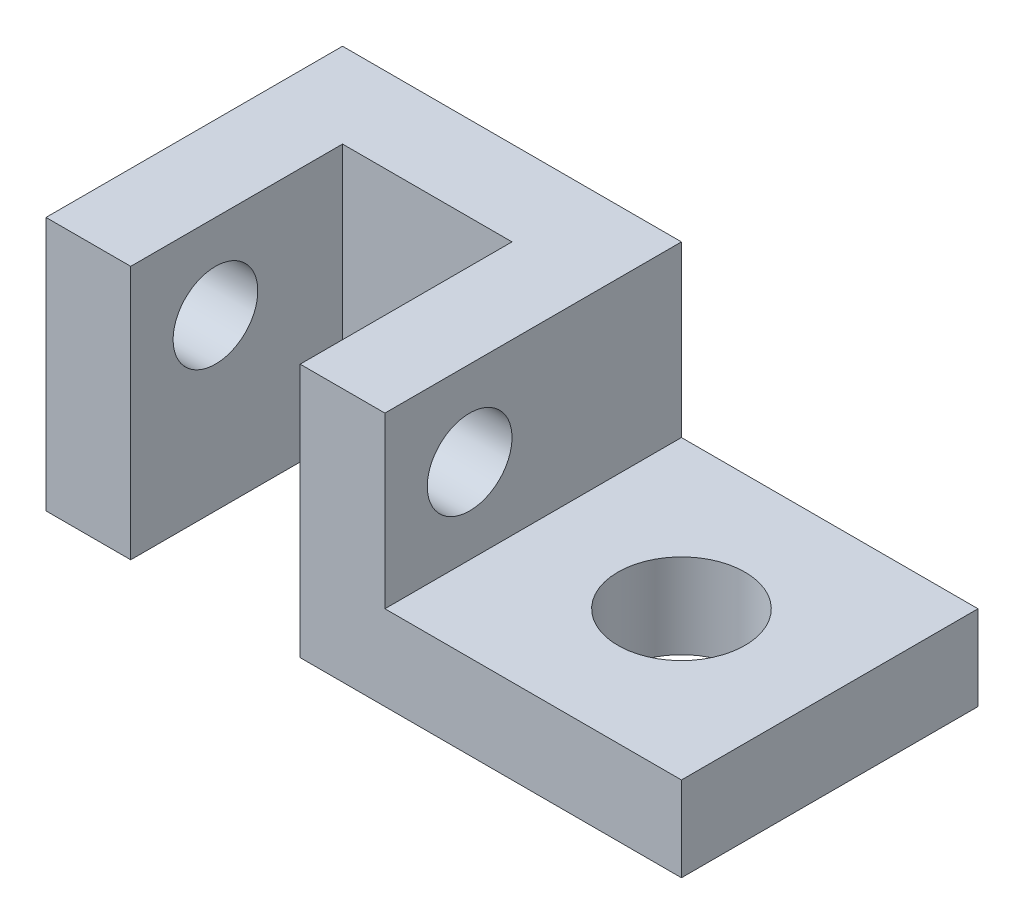
ISO-10303-21;
HEADER;
FILE_DESCRIPTION(('STEP AP214'),'2;1');
FILE_NAME('part.step','',(''),(''),'','','');
FILE_SCHEMA(('AUTOMOTIVE_DESIGN { 1 0 10303 214 1 1 1 1 }'));
ENDSEC;
DATA;
#1=APPLICATION_CONTEXT('core data for automotive mechanical design processes');
#2=APPLICATION_PROTOCOL_DEFINITION('international standard','automotive_design',2000,#1);
#3=PRODUCT_CONTEXT('',#1,'mechanical');
#4=PRODUCT('Part','Part','',(#3));
#5=PRODUCT_RELATED_PRODUCT_CATEGORY('part','',(#4));
#6=PRODUCT_DEFINITION_FORMATION('','',#4);
#7=PRODUCT_DEFINITION_CONTEXT('part definition',#1,'design');
#8=PRODUCT_DEFINITION('design','',#6,#7);
#9=PRODUCT_DEFINITION_SHAPE('','',#8);
#10=(LENGTH_UNIT() NAMED_UNIT(*) SI_UNIT(.MILLI.,.METRE.));
#11=(NAMED_UNIT(*) PLANE_ANGLE_UNIT() SI_UNIT($,.RADIAN.));
#12=(NAMED_UNIT(*) SI_UNIT($,.STERADIAN.) SOLID_ANGLE_UNIT());
#13=UNCERTAINTY_MEASURE_WITH_UNIT(LENGTH_MEASURE(1.E-05),#10,'distance_accuracy_value','');
#14=(GEOMETRIC_REPRESENTATION_CONTEXT(3) GLOBAL_UNCERTAINTY_ASSIGNED_CONTEXT((#13)) GLOBAL_UNIT_ASSIGNED_CONTEXT((#10,
#11,#12)) REPRESENTATION_CONTEXT('',''));
#15=CARTESIAN_POINT('',(0.,0.,0.));
#16=DIRECTION('',(0.,0.,1.));
#17=DIRECTION('',(1.,0.,0.));
#18=AXIS2_PLACEMENT_3D('',#15,#16,#17);
#19=CARTESIAN_POINT('',(0.,30.,0.));
#20=DIRECTION('',(0.,0.,-1.));
#21=DIRECTION('',(-1.,0.,0.));
#22=AXIS2_PLACEMENT_3D('',#19,#20,#21);
#23=PLANE('',#22);
#24=DIRECTION('',(1.,0.,0.));
#25=VECTOR('',#24,1.);
#26=CARTESIAN_POINT('',(0.,0.,0.));
#27=LINE('',#26,#25);
#28=CARTESIAN_POINT('',(0.,0.,0.));
#29=VERTEX_POINT('',#28);
#30=CARTESIAN_POINT('',(10.,0.,0.));
#31=VERTEX_POINT('',#30);
#32=EDGE_CURVE('E206',#29,#31,#27,.T.);
#33=ORIENTED_EDGE('',*,*,#32,.T.);
#34=DIRECTION('',(0.,-1.,0.));
#35=VECTOR('',#34,1.);
#36=CARTESIAN_POINT('',(10.,0.,0.));
#37=LINE('',#36,#35);
#38=CARTESIAN_POINT('',(10.,30.,0.));
#39=VERTEX_POINT('',#38);
#40=EDGE_CURVE('E153',#39,#31,#37,.T.);
#41=ORIENTED_EDGE('',*,*,#40,.F.);
#42=DIRECTION('',(1.,0.,0.));
#43=VECTOR('',#42,1.);
#44=CARTESIAN_POINT('',(0.,30.,0.));
#45=LINE('',#44,#43);
#46=CARTESIAN_POINT('',(0.,30.,0.));
#47=VERTEX_POINT('',#46);
#48=EDGE_CURVE('E195',#47,#39,#45,.T.);
#49=ORIENTED_EDGE('',*,*,#48,.F.);
#50=DIRECTION('',(0.,-1.,0.));
#51=VECTOR('',#50,1.);
#52=CARTESIAN_POINT('',(0.,30.,0.));
#53=LINE('',#52,#51);
#54=EDGE_CURVE('E11',#47,#29,#53,.T.);
#55=ORIENTED_EDGE('',*,*,#54,.T.);
#56=EDGE_LOOP('',(#33,#41,#49,#55));
#57=FACE_BOUND('',#56,.T.);
#58=ADVANCED_FACE('F39',(#57),#23,.F.);
#59=CARTESIAN_POINT('',(0.,30.,0.));
#60=DIRECTION('',(1.,0.,0.));
#61=DIRECTION('',(0.,0.,-1.));
#62=AXIS2_PLACEMENT_3D('',#59,#60,#61);
#63=PLANE('',#62);
#64=CARTESIAN_POINT('',(0.,20.,-10.));
#65=DIRECTION('',(-1.,0.,0.));
#66=DIRECTION('',(0.,0.,1.));
#67=AXIS2_PLACEMENT_3D('',#64,#65,#66);
#68=CIRCLE('',#67,5.);
#69=CARTESIAN_POINT('',(0.,20.,-5.));
#70=VERTEX_POINT('',#69);
#71=EDGE_CURVE('E388',#70,#70,#68,.T.);
#72=ORIENTED_EDGE('',*,*,#71,.F.);
#73=EDGE_LOOP('',(#72));
#74=FACE_BOUND('',#73,.T.);
#75=DIRECTION('',(0.,0.,1.));
#76=VECTOR('',#75,1.);
#77=CARTESIAN_POINT('',(0.,0.,0.));
#78=LINE('',#77,#76);
#79=CARTESIAN_POINT('',(0.,0.,-35.));
#80=VERTEX_POINT('',#79);
#81=EDGE_CURVE('E178',#80,#29,#78,.T.);
#82=ORIENTED_EDGE('',*,*,#81,.T.);
#83=ORIENTED_EDGE('',*,*,#54,.F.);
#84=DIRECTION('',(0.,0.,1.));
#85=VECTOR('',#84,1.);
#86=CARTESIAN_POINT('',(0.,30.,0.));
#87=LINE('',#86,#85);
#88=CARTESIAN_POINT('',(0.,30.,-35.));
#89=VERTEX_POINT('',#88);
#90=EDGE_CURVE('E189',#89,#47,#87,.T.);
#91=ORIENTED_EDGE('',*,*,#90,.F.);
#92=DIRECTION('',(0.,-1.,0.));
#93=VECTOR('',#92,1.);
#94=CARTESIAN_POINT('',(0.,30.,-35.));
#95=LINE('',#94,#93);
#96=EDGE_CURVE('E201',#89,#80,#95,.T.);
#97=ORIENTED_EDGE('',*,*,#96,.T.);
#98=EDGE_LOOP('',(#82,#83,#91,#97));
#99=FACE_BOUND('',#98,.T.);
#100=ADVANCED_FACE('F41',(#74,#99),#63,.F.);
#101=DIRECTION('',(0.,-1.,0.));
#102=VECTOR('',#101,1.);
#103=CARTESIAN_POINT('',(75.,30.,0.));
#104=LINE('',#103,#102);
#105=CARTESIAN_POINT('',(75.,10.,0.));
#106=VERTEX_POINT('',#105);
#107=CARTESIAN_POINT('',(75.,0.,0.));
#108=VERTEX_POINT('',#107);
#109=EDGE_CURVE('E49',#106,#108,#104,.T.);
#110=ORIENTED_EDGE('',*,*,#109,.F.);
#111=DIRECTION('',(1.,0.,0.));
#112=VECTOR('',#111,1.);
#113=CARTESIAN_POINT('',(75.,10.,0.));
#114=LINE('',#113,#112);
#115=CARTESIAN_POINT('',(40.,10.,0.));
#116=VERTEX_POINT('',#115);
#117=EDGE_CURVE('E141',#116,#106,#114,.T.);
#118=ORIENTED_EDGE('',*,*,#117,.F.);
#119=DIRECTION('',(0.,-1.,0.));
#120=VECTOR('',#119,1.);
#121=CARTESIAN_POINT('',(40.,30.,0.));
#122=LINE('',#121,#120);
#123=CARTESIAN_POINT('',(40.,30.,0.));
#124=VERTEX_POINT('',#123);
#125=EDGE_CURVE('E121',#124,#116,#122,.T.);
#126=ORIENTED_EDGE('',*,*,#125,.F.);
#127=CARTESIAN_POINT('',(30.,30.,0.));
#128=VERTEX_POINT('',#127);
#129=EDGE_CURVE('E193',#128,#124,#45,.T.);
#130=ORIENTED_EDGE('',*,*,#129,.F.);
#131=DIRECTION('',(0.,1.,0.));
#132=VECTOR('',#131,1.);
#133=CARTESIAN_POINT('',(30.,0.,0.));
#134=LINE('',#133,#132);
#135=CARTESIAN_POINT('',(30.,0.,0.));
#136=VERTEX_POINT('',#135);
#137=EDGE_CURVE('E160',#136,#128,#134,.T.);
#138=ORIENTED_EDGE('',*,*,#137,.F.);
#139=EDGE_CURVE('E205',#136,#108,#27,.T.);
#140=ORIENTED_EDGE('',*,*,#139,.T.);
#141=EDGE_LOOP('',(#110,#118,#126,#130,#138,#140));
#142=FACE_BOUND('',#141,.T.);
#143=ADVANCED_FACE('F232',(#142),#23,.F.);
#144=CARTESIAN_POINT('',(75.,30.,0.));
#145=DIRECTION('',(-1.,0.,0.));
#146=DIRECTION('',(0.,0.,1.));
#147=AXIS2_PLACEMENT_3D('',#144,#145,#146);
#148=PLANE('',#147);
#149=DIRECTION('',(0.,-1.,0.));
#150=VECTOR('',#149,1.);
#151=CARTESIAN_POINT('',(75.,30.,-35.));
#152=LINE('',#151,#150);
#153=CARTESIAN_POINT('',(75.,10.,-35.));
#154=VERTEX_POINT('',#153);
#155=CARTESIAN_POINT('',(75.,0.,-35.));
#156=VERTEX_POINT('',#155);
#157=EDGE_CURVE('E219',#154,#156,#152,.T.);
#158=ORIENTED_EDGE('',*,*,#157,.F.);
#159=DIRECTION('',(0.,0.,1.));
#160=VECTOR('',#159,1.);
#161=CARTESIAN_POINT('',(75.,10.,-35.));
#162=LINE('',#161,#160);
#163=EDGE_CURVE('E125',#154,#106,#162,.T.);
#164=ORIENTED_EDGE('',*,*,#163,.T.);
#165=ORIENTED_EDGE('',*,*,#109,.T.);
#166=DIRECTION('',(0.,0.,-1.));
#167=VECTOR('',#166,1.);
#168=CARTESIAN_POINT('',(75.,0.,0.));
#169=LINE('',#168,#167);
#170=EDGE_CURVE('E210',#108,#156,#169,.T.);
#171=ORIENTED_EDGE('',*,*,#170,.T.);
#172=EDGE_LOOP('',(#158,#164,#165,#171));
#173=FACE_BOUND('',#172,.T.);
#174=ADVANCED_FACE('F226',(#173),#148,.F.);
#175=CARTESIAN_POINT('',(0.,30.,-35.));
#176=DIRECTION('',(0.,0.,1.));
#177=DIRECTION('',(1.,0.,0.));
#178=AXIS2_PLACEMENT_3D('',#175,#176,#177);
#179=PLANE('',#178);
#180=DIRECTION('',(0.,-1.,0.));
#181=VECTOR('',#180,1.);
#182=CARTESIAN_POINT('',(40.,30.,-35.));
#183=LINE('',#182,#181);
#184=CARTESIAN_POINT('',(40.,30.,-35.));
#185=VERTEX_POINT('',#184);
#186=CARTESIAN_POINT('',(40.,10.,-35.));
#187=VERTEX_POINT('',#186);
#188=EDGE_CURVE('E56',#185,#187,#183,.T.);
#189=ORIENTED_EDGE('',*,*,#188,.T.);
#190=DIRECTION('',(1.,0.,0.));
#191=VECTOR('',#190,1.);
#192=CARTESIAN_POINT('',(75.,10.,-35.));
#193=LINE('',#192,#191);
#194=EDGE_CURVE('E129',#187,#154,#193,.T.);
#195=ORIENTED_EDGE('',*,*,#194,.T.);
#196=ORIENTED_EDGE('',*,*,#157,.T.);
#197=DIRECTION('',(-1.,0.,0.));
#198=VECTOR('',#197,1.);
#199=CARTESIAN_POINT('',(0.,0.,-35.));
#200=LINE('',#199,#198);
#201=EDGE_CURVE('E194',#156,#80,#200,.T.);
#202=ORIENTED_EDGE('',*,*,#201,.T.);
#203=ORIENTED_EDGE('',*,*,#96,.F.);
#204=DIRECTION('',(-1.,0.,0.));
#205=VECTOR('',#204,1.);
#206=CARTESIAN_POINT('',(0.,30.,-35.));
#207=LINE('',#206,#205);
#208=EDGE_CURVE('E139',#185,#89,#207,.T.);
#209=ORIENTED_EDGE('',*,*,#208,.F.);
#210=EDGE_LOOP('',(#189,#195,#196,#202,#203,#209));
#211=FACE_BOUND('',#210,.T.);
#212=ADVANCED_FACE('F137',(#211),#179,.F.);
#213=CARTESIAN_POINT('',(0.,30.,0.));
#214=DIRECTION('',(0.,-1.,0.));
#215=DIRECTION('',(0.,0.,-1.));
#216=AXIS2_PLACEMENT_3D('',#213,#214,#215);
#217=PLANE('',#216);
#218=ORIENTED_EDGE('',*,*,#129,.T.);
#219=DIRECTION('',(0.,0.,1.));
#220=VECTOR('',#219,1.);
#221=CARTESIAN_POINT('',(40.,30.,-35.));
#222=LINE('',#221,#220);
#223=EDGE_CURVE('E126',#185,#124,#222,.T.);
#224=ORIENTED_EDGE('',*,*,#223,.F.);
#225=ORIENTED_EDGE('',*,*,#208,.T.);
#226=ORIENTED_EDGE('',*,*,#90,.T.);
#227=ORIENTED_EDGE('',*,*,#48,.T.);
#228=DIRECTION('',(0.,0.,1.));
#229=VECTOR('',#228,1.);
#230=CARTESIAN_POINT('',(10.,30.,-25.));
#231=LINE('',#230,#229);
#232=CARTESIAN_POINT('',(10.,30.,-25.));
#233=VERTEX_POINT('',#232);
#234=EDGE_CURVE('E175',#233,#39,#231,.T.);
#235=ORIENTED_EDGE('',*,*,#234,.F.);
#236=DIRECTION('',(-1.,0.,0.));
#237=VECTOR('',#236,1.);
#238=CARTESIAN_POINT('',(10.,30.,-25.));
#239=LINE('',#238,#237);
#240=CARTESIAN_POINT('',(30.,30.,-25.));
#241=VERTEX_POINT('',#240);
#242=EDGE_CURVE('E167',#241,#233,#239,.T.);
#243=ORIENTED_EDGE('',*,*,#242,.F.);
#244=DIRECTION('',(0.,0.,1.));
#245=VECTOR('',#244,1.);
#246=CARTESIAN_POINT('',(30.,30.,-25.));
#247=LINE('',#246,#245);
#248=EDGE_CURVE('E179',#241,#128,#247,.T.);
#249=ORIENTED_EDGE('',*,*,#248,.T.);
#250=EDGE_LOOP('',(#218,#224,#225,#226,#227,#235,#243,#249));
#251=FACE_BOUND('',#250,.T.);
#252=ADVANCED_FACE('F244',(#251),#217,.F.);
#253=CARTESIAN_POINT('',(0.,0.,0.));
#254=DIRECTION('',(0.,-1.,0.));
#255=DIRECTION('',(0.,0.,-1.));
#256=AXIS2_PLACEMENT_3D('',#253,#254,#255);
#257=PLANE('',#256);
#258=CARTESIAN_POINT('',(57.5,0.,-17.5));
#259=DIRECTION('',(0.,1.,0.));
#260=DIRECTION('',(-1.,0.,0.));
#261=AXIS2_PLACEMENT_3D('',#258,#259,#260);
#262=CIRCLE('',#261,7.50000000000001);
#263=CARTESIAN_POINT('',(50.,0.,-17.5));
#264=VERTEX_POINT('',#263);
#265=EDGE_CURVE('E150',#264,#264,#262,.T.);
#266=ORIENTED_EDGE('',*,*,#265,.T.);
#267=EDGE_LOOP('',(#266));
#268=FACE_BOUND('',#267,.T.);
#269=DIRECTION('',(0.,0.,1.));
#270=VECTOR('',#269,1.);
#271=CARTESIAN_POINT('',(10.,0.,-25.));
#272=LINE('',#271,#270);
#273=CARTESIAN_POINT('',(10.,0.,-25.));
#274=VERTEX_POINT('',#273);
#275=EDGE_CURVE('E170',#274,#31,#272,.T.);
#276=ORIENTED_EDGE('',*,*,#275,.T.);
#277=ORIENTED_EDGE('',*,*,#32,.F.);
#278=ORIENTED_EDGE('',*,*,#81,.F.);
#279=ORIENTED_EDGE('',*,*,#201,.F.);
#280=ORIENTED_EDGE('',*,*,#170,.F.);
#281=ORIENTED_EDGE('',*,*,#139,.F.);
#282=DIRECTION('',(0.,0.,1.));
#283=VECTOR('',#282,1.);
#284=CARTESIAN_POINT('',(30.,0.,-25.));
#285=LINE('',#284,#283);
#286=CARTESIAN_POINT('',(30.,0.,-25.));
#287=VERTEX_POINT('',#286);
#288=EDGE_CURVE('E183',#287,#136,#285,.T.);
#289=ORIENTED_EDGE('',*,*,#288,.F.);
#290=DIRECTION('',(1.,0.,0.));
#291=VECTOR('',#290,1.);
#292=CARTESIAN_POINT('',(10.,0.,-25.));
#293=LINE('',#292,#291);
#294=EDGE_CURVE('E159',#274,#287,#293,.T.);
#295=ORIENTED_EDGE('',*,*,#294,.F.);
#296=EDGE_LOOP('',(#276,#277,#278,#279,#280,#281,#289,#295));
#297=FACE_BOUND('',#296,.T.);
#298=ADVANCED_FACE('F237',(#268,#297),#257,.T.);
#299=CARTESIAN_POINT('',(10.,0.,-25.));
#300=DIRECTION('',(-1.,0.,0.));
#301=DIRECTION('',(0.,0.,1.));
#302=AXIS2_PLACEMENT_3D('',#299,#300,#301);
#303=PLANE('',#302);
#304=CARTESIAN_POINT('',(9.99999999999999,20.,-10.));
#305=DIRECTION('',(-1.,0.,0.));
#306=DIRECTION('',(0.,0.,1.));
#307=AXIS2_PLACEMENT_3D('',#304,#305,#306);
#308=CIRCLE('',#307,5.);
#309=CARTESIAN_POINT('',(9.99999999999999,20.,-5.));
#310=VERTEX_POINT('',#309);
#311=EDGE_CURVE('E390',#310,#310,#308,.T.);
#312=ORIENTED_EDGE('',*,*,#311,.T.);
#313=EDGE_LOOP('',(#312));
#314=FACE_BOUND('',#313,.T.);
#315=ORIENTED_EDGE('',*,*,#40,.T.);
#316=ORIENTED_EDGE('',*,*,#275,.F.);
#317=DIRECTION('',(0.,-1.,0.));
#318=VECTOR('',#317,1.);
#319=CARTESIAN_POINT('',(10.,0.,-25.));
#320=LINE('',#319,#318);
#321=EDGE_CURVE('E64',#233,#274,#320,.T.);
#322=ORIENTED_EDGE('',*,*,#321,.F.);
#323=ORIENTED_EDGE('',*,*,#234,.T.);
#324=EDGE_LOOP('',(#315,#316,#322,#323));
#325=FACE_BOUND('',#324,.T.);
#326=ADVANCED_FACE('F255',(#314,#325),#303,.F.);
#327=CARTESIAN_POINT('',(30.,0.,-25.));
#328=DIRECTION('',(1.,0.,0.));
#329=DIRECTION('',(0.,0.,-1.));
#330=AXIS2_PLACEMENT_3D('',#327,#328,#329);
#331=PLANE('',#330);
#332=CARTESIAN_POINT('',(30.,20.,-10.));
#333=DIRECTION('',(1.,0.,0.));
#334=DIRECTION('',(0.,0.,-1.));
#335=AXIS2_PLACEMENT_3D('',#332,#333,#334);
#336=CIRCLE('',#335,5.);
#337=CARTESIAN_POINT('',(30.,20.,-15.));
#338=VERTEX_POINT('',#337);
#339=EDGE_CURVE('E392',#338,#338,#336,.T.);
#340=ORIENTED_EDGE('',*,*,#339,.T.);
#341=EDGE_LOOP('',(#340));
#342=FACE_BOUND('',#341,.T.);
#343=ORIENTED_EDGE('',*,*,#137,.T.);
#344=ORIENTED_EDGE('',*,*,#248,.F.);
#345=DIRECTION('',(0.,1.,0.));
#346=VECTOR('',#345,1.);
#347=CARTESIAN_POINT('',(30.,0.,-25.));
#348=LINE('',#347,#346);
#349=EDGE_CURVE('E163',#287,#241,#348,.T.);
#350=ORIENTED_EDGE('',*,*,#349,.F.);
#351=ORIENTED_EDGE('',*,*,#288,.T.);
#352=EDGE_LOOP('',(#343,#344,#350,#351));
#353=FACE_BOUND('',#352,.T.);
#354=ADVANCED_FACE('F249',(#342,#353),#331,.F.);
#355=CARTESIAN_POINT('',(0.,0.,-25.));
#356=DIRECTION('',(0.,0.,-1.));
#357=DIRECTION('',(-1.,0.,0.));
#358=AXIS2_PLACEMENT_3D('',#355,#356,#357);
#359=PLANE('',#358);
#360=ORIENTED_EDGE('',*,*,#321,.T.);
#361=ORIENTED_EDGE('',*,*,#294,.T.);
#362=ORIENTED_EDGE('',*,*,#349,.T.);
#363=ORIENTED_EDGE('',*,*,#242,.T.);
#364=EDGE_LOOP('',(#360,#361,#362,#363));
#365=FACE_BOUND('',#364,.T.);
#366=ADVANCED_FACE('F250',(#365),#359,.F.);
#367=CARTESIAN_POINT('',(75.,10.,-35.));
#368=DIRECTION('',(0.,-1.,0.));
#369=DIRECTION('',(1.,0.,0.));
#370=AXIS2_PLACEMENT_3D('',#367,#368,#369);
#371=PLANE('',#370);
#372=CARTESIAN_POINT('',(57.5,10.,-17.5));
#373=DIRECTION('',(0.,1.,0.));
#374=DIRECTION('',(-1.,0.,0.));
#375=AXIS2_PLACEMENT_3D('',#372,#373,#374);
#376=CIRCLE('',#375,7.50000000000001);
#377=CARTESIAN_POINT('',(50.,10.,-17.5));
#378=VERTEX_POINT('',#377);
#379=EDGE_CURVE('E146',#378,#378,#376,.T.);
#380=ORIENTED_EDGE('',*,*,#379,.F.);
#381=EDGE_LOOP('',(#380));
#382=FACE_BOUND('',#381,.T.);
#383=ORIENTED_EDGE('',*,*,#117,.T.);
#384=ORIENTED_EDGE('',*,*,#163,.F.);
#385=ORIENTED_EDGE('',*,*,#194,.F.);
#386=DIRECTION('',(0.,0.,1.));
#387=VECTOR('',#386,1.);
#388=CARTESIAN_POINT('',(40.,10.,-35.));
#389=LINE('',#388,#387);
#390=EDGE_CURVE('E117',#187,#116,#389,.T.);
#391=ORIENTED_EDGE('',*,*,#390,.T.);
#392=EDGE_LOOP('',(#383,#384,#385,#391));
#393=FACE_BOUND('',#392,.T.);
#394=ADVANCED_FACE('F130',(#382,#393),#371,.F.);
#395=CARTESIAN_POINT('',(40.,30.,-35.));
#396=DIRECTION('',(-1.,0.,0.));
#397=DIRECTION('',(0.,0.,1.));
#398=AXIS2_PLACEMENT_3D('',#395,#396,#397);
#399=PLANE('',#398);
#400=CARTESIAN_POINT('',(40.,20.,-10.));
#401=DIRECTION('',(-1.,0.,0.));
#402=DIRECTION('',(0.,0.,1.));
#403=AXIS2_PLACEMENT_3D('',#400,#401,#402);
#404=CIRCLE('',#403,5.);
#405=CARTESIAN_POINT('',(40.,20.,-5.));
#406=VERTEX_POINT('',#405);
#407=EDGE_CURVE('E43',#406,#406,#404,.T.);
#408=ORIENTED_EDGE('',*,*,#407,.T.);
#409=EDGE_LOOP('',(#408));
#410=FACE_BOUND('',#409,.T.);
#411=ORIENTED_EDGE('',*,*,#125,.T.);
#412=ORIENTED_EDGE('',*,*,#390,.F.);
#413=ORIENTED_EDGE('',*,*,#188,.F.);
#414=ORIENTED_EDGE('',*,*,#223,.T.);
#415=EDGE_LOOP('',(#411,#412,#413,#414));
#416=FACE_BOUND('',#415,.T.);
#417=ADVANCED_FACE('F119',(#410,#416),#399,.F.);
#418=CARTESIAN_POINT('',(57.5,0.,-17.5));
#419=DIRECTION('',(0.,1.,0.));
#420=DIRECTION('',(-1.,0.,0.));
#421=AXIS2_PLACEMENT_3D('',#418,#419,#420);
#422=CYLINDRICAL_SURFACE('',#421,7.50000000000001);
#423=ORIENTED_EDGE('',*,*,#265,.F.);
#424=EDGE_LOOP('',(#423));
#425=FACE_BOUND('',#424,.T.);
#426=ORIENTED_EDGE('',*,*,#379,.T.);
#427=EDGE_LOOP('',(#426));
#428=FACE_BOUND('',#427,.T.);
#429=ADVANCED_FACE('F311',(#425,#428),#422,.F.);
#430=CARTESIAN_POINT('',(75.,20.,-10.));
#431=DIRECTION('',(-1.,0.,0.));
#432=DIRECTION('',(0.,0.,1.));
#433=AXIS2_PLACEMENT_3D('',#430,#431,#432);
#434=CYLINDRICAL_SURFACE('',#433,5.);
#435=ORIENTED_EDGE('',*,*,#407,.F.);
#436=EDGE_LOOP('',(#435));
#437=FACE_BOUND('',#436,.T.);
#438=ORIENTED_EDGE('',*,*,#339,.F.);
#439=EDGE_LOOP('',(#438));
#440=FACE_BOUND('',#439,.T.);
#441=ADVANCED_FACE('F316',(#437,#440),#434,.F.);
#442=ORIENTED_EDGE('',*,*,#71,.T.);
#443=EDGE_LOOP('',(#442));
#444=FACE_BOUND('',#443,.T.);
#445=ORIENTED_EDGE('',*,*,#311,.F.);
#446=EDGE_LOOP('',(#445));
#447=FACE_BOUND('',#446,.T.);
#448=ADVANCED_FACE('F350',(#444,#447),#434,.F.);
#449=CLOSED_SHELL('',(#58,#100,#143,#174,#212,#252,#298,#326,#354,#366,#394,#417,#429,#441,#448));
#450=MANIFOLD_SOLID_BREP('B2',#449);
#451=ADVANCED_BREP_SHAPE_REPRESENTATION('',(#18,#450),#14);
#452=SHAPE_DEFINITION_REPRESENTATION(#9,#451);
ENDSEC;
END-ISO-10303-21;
